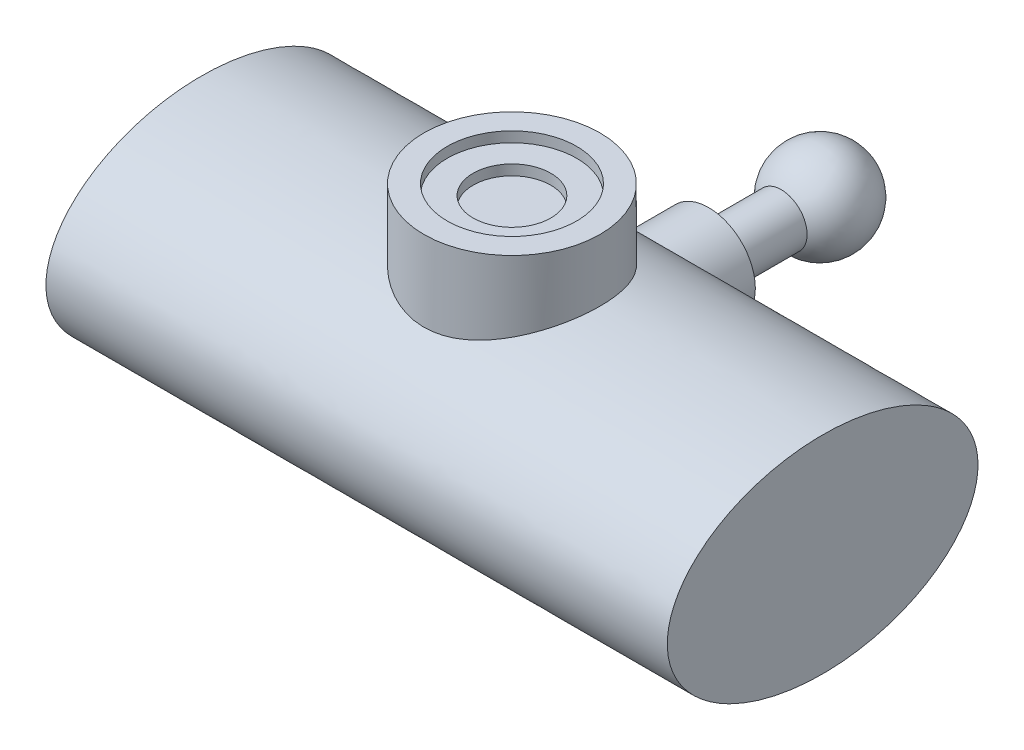
ISO-10303-21;
HEADER;
FILE_DESCRIPTION(('STEP AP214'),'2;1');
FILE_NAME('part.step','',(''),(''),'','','');
FILE_SCHEMA(('AUTOMOTIVE_DESIGN { 1 0 10303 214 1 1 1 1 }'));
ENDSEC;
DATA;
#1=APPLICATION_CONTEXT('core data for automotive mechanical design processes');
#2=APPLICATION_PROTOCOL_DEFINITION('international standard','automotive_design',2000,#1);
#3=PRODUCT_CONTEXT('',#1,'mechanical');
#4=PRODUCT('Part','Part','',(#3));
#5=PRODUCT_RELATED_PRODUCT_CATEGORY('part','',(#4));
#6=PRODUCT_DEFINITION_FORMATION('','',#4);
#7=PRODUCT_DEFINITION_CONTEXT('part definition',#1,'design');
#8=PRODUCT_DEFINITION('design','',#6,#7);
#9=PRODUCT_DEFINITION_SHAPE('','',#8);
#10=(LENGTH_UNIT() NAMED_UNIT(*) SI_UNIT(.MILLI.,.METRE.));
#11=(NAMED_UNIT(*) PLANE_ANGLE_UNIT() SI_UNIT($,.RADIAN.));
#12=(NAMED_UNIT(*) SI_UNIT($,.STERADIAN.) SOLID_ANGLE_UNIT());
#13=UNCERTAINTY_MEASURE_WITH_UNIT(LENGTH_MEASURE(1.E-05),#10,'distance_accuracy_value','');
#14=(GEOMETRIC_REPRESENTATION_CONTEXT(3) GLOBAL_UNCERTAINTY_ASSIGNED_CONTEXT((#13)) GLOBAL_UNIT_ASSIGNED_CONTEXT((#10,
#11,#12)) REPRESENTATION_CONTEXT('',''));
#15=CARTESIAN_POINT('',(0.,0.,0.));
#16=DIRECTION('',(0.,0.,1.));
#17=DIRECTION('',(1.,0.,0.));
#18=AXIS2_PLACEMENT_3D('',#15,#16,#17);
#19=CARTESIAN_POINT('',(-30.,0.,26.));
#20=DIRECTION('',(1.,0.,0.));
#21=DIRECTION('',(0.,0.,-1.));
#22=AXIS2_PLACEMENT_3D('',#19,#20,#21);
#23=ELLIPSE('',#22,15.,10.);
#24=DIRECTION('',(1.,0.,0.));
#25=VECTOR('',#24,1.);
#26=SURFACE_OF_LINEAR_EXTRUSION('',#23,#25);
#27=CARTESIAN_POINT('',(-4.5,0.,11.));
#28=CARTESIAN_POINT('',(-4.50000179661353,0.113427751797759,10.999998104076));
#29=CARTESIAN_POINT('',(-4.49570683559703,0.226836941344397,11.002901009246));
#30=CARTESIAN_POINT('',(-4.47859826356174,0.452757044180179,11.0144232925091));
#31=CARTESIAN_POINT('',(-4.46578222935199,0.565267692732317,11.0230442966921));
#32=CARTESIAN_POINT('',(-4.43180974817744,0.788562805828208,11.0457667567975));
#33=CARTESIAN_POINT('',(-4.41064538078484,0.899345526949475,11.0598734170206));
#34=CARTESIAN_POINT('',(-4.36027244405676,1.11832652619657,11.0931795221124));
#35=CARTESIAN_POINT('',(-4.33106041679894,1.2265236715837,11.1123811560608));
#36=CARTESIAN_POINT('',(-4.26517045877855,1.4389622519027,11.1552431101488));
#37=CARTESIAN_POINT('',(-4.22853884802476,1.54322368635741,11.1788757031795));
#38=CARTESIAN_POINT('',(-4.14810455225398,1.74795320879676,11.2301062680023));
#39=CARTESIAN_POINT('',(-4.10429905696046,1.84841979113998,11.2577057932682));
#40=CARTESIAN_POINT('',(-3.96276861330985,2.14335152297756,11.3455197985101));
#41=CARTESIAN_POINT('',(-3.85486940196405,2.33154018599745,11.4107901373745));
#42=CARTESIAN_POINT('',(-3.60392158054914,2.70501209204091,11.5560344890988));
#43=CARTESIAN_POINT('',(-3.45853379199128,2.88838865227078,11.6368120136786));
#44=CARTESIAN_POINT('',(-3.14178140430147,3.23009476219036,11.8015115384798));
#45=CARTESIAN_POINT('',(-2.9703833618687,3.38839152146735,11.8854374807371));
#46=CARTESIAN_POINT('',(-2.68273694898729,3.61533784930147,12.0139878374257));
#47=CARTESIAN_POINT('',(-2.57435341999766,3.69332312112326,12.0600339860247));
#48=CARTESIAN_POINT('',(-2.35022785291713,3.83983685883343,12.1493942924411));
#49=CARTESIAN_POINT('',(-2.23448450976205,3.90836364064517,12.1927079629995));
#50=CARTESIAN_POINT('',(-1.99631105152499,4.03521042570358,12.2750533001104));
#51=CARTESIAN_POINT('',(-1.87389086705864,4.09354507251045,12.3140910794386));
#52=CARTESIAN_POINT('',(-1.62284749952471,4.1993929358368,12.3864372558138));
#53=CARTESIAN_POINT('',(-1.4942268565902,4.24691053886781,12.4197479739441));
#54=CARTESIAN_POINT('',(-1.26509018908745,4.31973368078795,12.4716061814889));
#55=CARTESIAN_POINT('',(-1.16574768179169,4.34761470798694,12.4917536413799));
#56=CARTESIAN_POINT('',(-0.964612007304901,4.39661582407501,12.5274851960585));
#57=CARTESIAN_POINT('',(-0.862819399121535,4.41773743974061,12.5430703212919));
#58=CARTESIAN_POINT('',(-0.657476723721926,4.45292768238192,12.5691922199446));
#59=CARTESIAN_POINT('',(-0.553928380872625,4.46700285717636,12.5797336797233));
#60=CARTESIAN_POINT('',(-0.345691829615696,4.48792223892815,12.5954464292999));
#61=CARTESIAN_POINT('',(-0.241003597346981,4.49476629422273,12.6006176064634));
#62=CARTESIAN_POINT('',(-0.0310453054331663,4.50112106870681,12.6054180778743));
#63=CARTESIAN_POINT('',(0.0742255277903985,4.50061560625957,12.6050351434851));
#64=CARTESIAN_POINT('',(0.284304014194313,4.49224025645326,12.5987109629353));
#65=CARTESIAN_POINT('',(0.389111666587928,4.48437035659018,12.5927697073373));
#66=CARTESIAN_POINT('',(0.59753363976473,4.46138456087639,12.5755269335715));
#67=CARTESIAN_POINT('',(0.70114731240602,4.44626490329595,12.5642226326772));
#68=CARTESIAN_POINT('',(0.906420191381641,4.40900057668016,12.5366209701257));
#69=CARTESIAN_POINT('',(1.00807936731996,4.38685579848486,12.5203235308826));
#70=CARTESIAN_POINT('',(1.20684557721036,4.33633809787617,12.4835980616951));
#71=CARTESIAN_POINT('',(1.3040029534458,4.30809806452624,12.4632588050804));
#72=CARTESIAN_POINT('',(1.49543340489877,4.24544833923509,12.4187969731321));
#73=CARTESIAN_POINT('',(1.58970548077597,4.21103653735249,12.3946731043083));
#74=CARTESIAN_POINT('',(1.86759038030875,4.09902022836665,12.3175003233271));
#75=CARTESIAN_POINT('',(2.04638550636764,4.01260547275993,12.2596281114524));
#76=CARTESIAN_POINT('',(2.41679295890204,3.80283298823422,12.1257342598217));
#77=CARTESIAN_POINT('',(2.60576432697492,3.67575343801002,12.0482915618635));
#78=CARTESIAN_POINT('',(2.96165670497873,3.39558471419742,11.8894313029242));
#79=CARTESIAN_POINT('',(3.12855059043843,3.24246406449339,11.8080090176696));
#80=CARTESIAN_POINT('',(3.46408364274005,2.88440804907728,11.6343295005055));
#81=CARTESIAN_POINT('',(3.62837513293085,2.67509021151676,11.5425289658539));
#82=CARTESIAN_POINT('',(3.84650148734915,2.33928769412491,11.4151611589783));
#83=CARTESIAN_POINT('',(3.91449348979772,2.22371190570305,11.3744262675036));
#84=CARTESIAN_POINT('',(4.04042479072698,1.98571503458002,11.2975729325259));
#85=CARTESIAN_POINT('',(4.09836705045653,1.86329598241597,11.2614531299735));
#86=CARTESIAN_POINT('',(4.1925136057426,1.63843067480823,11.2019279765487));
#87=CARTESIAN_POINT('',(4.2307339239465,1.53710867483584,11.1774393910207));
#88=CARTESIAN_POINT('',(4.29998446964481,1.33113882007355,11.1326700450054));
#89=CARTESIAN_POINT('',(4.33101618728443,1.22649165968925,11.1123884125382));
#90=CARTESIAN_POINT('',(4.3855094700779,1.01453053362565,11.0765382428872));
#91=CARTESIAN_POINT('',(4.40897647643548,0.907218544834051,11.0609663185684));
#92=CARTESIAN_POINT('',(4.44806119478178,0.690556060860621,11.0349200564462));
#93=CARTESIAN_POINT('',(4.46367877421417,0.581205531285499,11.0244458047293));
#94=CARTESIAN_POINT('',(4.48687763286799,0.360887958636143,11.0088554284552));
#95=CARTESIAN_POINT('',(4.49443095207693,0.249916634964487,11.0037579467049));
#96=CARTESIAN_POINT('',(4.50128932226477,0.0276022757401435,10.9991303202973));
#97=CARTESIAN_POINT('',(4.50059437511811,-0.0837407597280662,10.9996001743749));
#98=CARTESIAN_POINT('',(4.49096626715139,-0.305922193008737,11.0060942616813));
#99=CARTESIAN_POINT('',(4.48203186670135,-0.416760512364704,11.0121193306951));
#100=CARTESIAN_POINT('',(4.45606001427732,-0.637048543935594,11.029553870837));
#101=CARTESIAN_POINT('',(4.43902270985223,-0.746498281398482,11.0409632439203));
#102=CARTESIAN_POINT('',(4.39816713569207,-0.957646057710932,11.0681380131166));
#103=CARTESIAN_POINT('',(4.37474242379664,-1.05945337025825,11.0836493637226));
#104=CARTESIAN_POINT('',(4.32109931219396,-1.2605329468572,11.1188718356031));
#105=CARTESIAN_POINT('',(4.29087858863244,-1.35980433080277,11.1385843933337));
#106=CARTESIAN_POINT('',(4.1905005340399,-1.65296873635818,11.2033829235758));
#107=CARTESIAN_POINT('',(4.11059693349983,-1.84236612863191,11.2541505781957));
#108=CARTESIAN_POINT('',(3.91877250619583,-2.22329796423974,11.3722371155674));
#109=CARTESIAN_POINT('',(3.80451271966262,-2.413288590017,11.4406777339753));
#110=CARTESIAN_POINT('',(3.5511301526749,-2.7727038914783,11.5854144415518));
#111=CARTESIAN_POINT('',(3.41198359303289,-2.94210863515252,11.6617180139171));
#112=CARTESIAN_POINT('',(3.08631648900501,-3.28472085582264,11.829309093388));
#113=CARTESIAN_POINT('',(2.89576699053932,-3.45392474195579,11.9209878613513));
#114=CARTESIAN_POINT('',(2.48696209994966,-3.75899613254762,12.0979294572261));
#115=CARTESIAN_POINT('',(2.26871396155728,-3.89487233765052,12.1831939556316));
#116=CARTESIAN_POINT('',(1.84397141975699,-4.11059794030257,12.3249182480302));
#117=CARTESIAN_POINT('',(1.64110822990307,-4.19591661167427,12.3838018973718));
#118=CARTESIAN_POINT('',(1.32629457494211,-4.30153704143316,12.4585404951784));
#119=CARTESIAN_POINT('',(1.21960759709212,-4.33301685356221,12.4811883078199));
#120=CARTESIAN_POINT('',(1.00328986689162,-4.38814860065665,12.5212587563962));
#121=CARTESIAN_POINT('',(0.893660466169043,-4.41180406545493,12.5386837481917));
#122=CARTESIAN_POINT('',(0.671387824061793,-4.45107495470949,12.5678022585084));
#123=CARTESIAN_POINT('',(0.558728579140754,-4.4666313400165,12.5794536609622));
#124=CARTESIAN_POINT('',(0.332073640419358,-4.48917523480886,12.5963885825209));
#125=CARTESIAN_POINT('',(0.218077954497075,-4.49616279478024,12.6016721391439));
#126=CARTESIAN_POINT('',(-0.0102109097294636,-4.5014364012271,12.6056568556563));
#127=CARTESIAN_POINT('',(-0.124504034273567,-4.49972392396281,12.604359132286));
#128=CARTESIAN_POINT('',(-0.3523605073897,-4.48763387513054,12.5952369613043));
#129=CARTESIAN_POINT('',(-0.465923899310071,-4.47725682315053,12.5874129050571));
#130=CARTESIAN_POINT('',(-0.67923468310089,-4.44959929737168,12.5667252536962));
#131=CARTESIAN_POINT('',(-0.779156752898353,-4.43317928607142,12.5544926666724));
#132=CARTESIAN_POINT('',(-0.977042697073361,-4.39381133925923,12.5254491587045));
#133=CARTESIAN_POINT('',(-1.07500591430874,-4.37086125113962,12.5086367281154));
#134=CARTESIAN_POINT('',(-1.36511414597717,-4.29261252060113,12.4520128996179));
#135=CARTESIAN_POINT('',(-1.55359686105713,-4.22789955962537,12.4060025334264));
#136=CARTESIAN_POINT('',(-1.93310950394273,-4.06927952389765,12.2974236488978));
#137=CARTESIAN_POINT('',(-2.122961598469,-3.97333863531185,12.233770590982));
#138=CARTESIAN_POINT('',(-2.48517306088189,-3.75745013592127,12.0980430526655));
#139=CARTESIAN_POINT('',(-2.65752147832485,-3.63748763474619,12.0259633604053));
#140=CARTESIAN_POINT('',(-3.01530948599678,-3.34969077399854,11.8643378935222));
#141=CARTESIAN_POINT('',(-3.19666612782305,-3.17708160832445,11.7741433128102));
#142=CARTESIAN_POINT('',(-3.4460710098894,-2.89659995275487,11.6422994952934));
#143=CARTESIAN_POINT('',(-3.52549816686507,-2.79941005551074,11.5988871174457));
#144=CARTESIAN_POINT('',(-3.67639443055727,-2.59806555930813,11.5142416740982));
#145=CARTESIAN_POINT('',(-3.74786221934094,-2.49390981148232,11.4730089701066));
#146=CARTESIAN_POINT('',(-3.88653423833227,-2.27222651620535,11.3912915177966));
#147=CARTESIAN_POINT('',(-3.95318017729316,-2.15426984842072,11.3510202467923));
#148=CARTESIAN_POINT('',(-4.076059538743,-1.91160147196229,11.2754448375747));
#149=CARTESIAN_POINT('',(-4.13229869870981,-1.78689353472326,11.2401379649774));
#150=CARTESIAN_POINT('',(-4.23348505678554,-1.53179028546055,11.1757571788904));
#151=CARTESIAN_POINT('',(-4.27846027883129,-1.40141005473585,11.1466678236252));
#152=CARTESIAN_POINT('',(-4.35649158363439,-1.13583379404724,11.0957216245096));
#153=CARTESIAN_POINT('',(-4.38955548718639,-1.0006409882668,11.0738600357939));
#154=CARTESIAN_POINT('',(-4.44399003871495,-0.722290681803393,11.037665045924));
#155=CARTESIAN_POINT('',(-4.4649479028609,-0.579017000181097,11.0235979987963));
#156=CARTESIAN_POINT('',(-4.49295171576239,-0.290485399314258,11.0047667013232));
#157=CARTESIAN_POINT('',(-4.4999976997017,-0.145227485088864,11.0000024274507));
#158=CARTESIAN_POINT('',(-4.5,0.,11.));
#159=B_SPLINE_CURVE_WITH_KNOTS('',3,(#27,#28,#29,#30,#31,#32,#33,#34,#35,#36,#37,#38,#39,#40,
#41,#42,#43,#44,#45,#46,#47,#48,#49,#50,#51,#52,#53,#54,#55,#56,#57,#58,#59,#60,#61,#62,#63,#64,
#65,#66,#67,#68,#69,#70,#71,#72,#73,#74,#75,#76,#77,#78,#79,#80,#81,#82,#83,#84,#85,#86,#87,#88,
#89,#90,#91,#92,#93,#94,#95,#96,#97,#98,#99,#100,#101,#102,#103,#104,#105,#106,#107,#108,#109,
#110,#111,#112,#113,#114,#115,#116,#117,#118,#119,#120,#121,#122,#123,#124,#125,#126,#127,#128,
#129,#130,#131,#132,#133,#134,#135,#136,#137,#138,#139,#140,#141,#142,#143,#144,#145,#146,#147,
#148,#149,#150,#151,#152,#153,#154,#155,#156,#157,#158),.UNSPECIFIED.,.T.,.F.,(4,2,2,2,2,2,2,2,
2,2,2,2,2,2,2,2,2,2,2,2,2,2,2,2,2,2,2,2,2,2,2,2,2,2,2,2,2,2,2,2,2,2,2,2,2,2,2,2,2,2,2,2,2,2,2,2,
2,2,2,2,2,2,2,2,2,4),(0.,0.340133977224594,0.680364721873554,1.02091903766603,1.36161991184411,
1.70025597043293,2.03902500404053,2.71595528338829,3.45599766251007,4.19699975952383,
4.62027501382067,5.04362553499175,5.46636271360192,5.88892815786315,6.20400329255007,
6.51900720958741,6.83371786724526,7.14843512539484,7.46384540997294,7.77925623008434,
8.09483088688747,8.41041044749295,8.71970201041908,9.0290995130492,9.6475397386973,
10.3665098752997,11.086355295658,11.9262098886761,12.3461636741822,12.7659935054501,
13.098739900695,13.4314172581587,13.7638547881668,14.0962979319883,14.4298900002783,
14.7634819927587,15.0971241825146,15.4307602970841,15.7472473454301,16.0638427795728,
16.6965634639746,17.3900897781859,18.0842823283624,18.8932694758549,19.7020452009277,
20.3824710118762,20.7226592902244,21.0626938879199,21.4051736737468,21.7476514417328,
22.0900710985393,22.4324702229634,22.7381204964925,23.0438716430928,23.6550155642333,
24.3187766546416,24.9829504740448,25.7776417863957,26.1757352892663,26.5738946117947,
26.9973185201674,27.4205082858827,27.8426344835977,28.2644830121933,28.699975440192,
29.1354667668091),.UNSPECIFIED.);
#160=CARTESIAN_POINT('',(-4.5,0.,11.));
#161=VERTEX_POINT('',#160);
#162=EDGE_CURVE('E86',#161,#161,#159,.T.);
#163=ORIENTED_EDGE('',*,*,#162,.F.);
#164=EDGE_LOOP('',(#163));
#165=FACE_BOUND('',#164,.T.);
#166=CARTESIAN_POINT('',(30.,0.,26.));
#167=DIRECTION('',(1.,0.,0.));
#168=DIRECTION('',(0.,0.,-1.));
#169=AXIS2_PLACEMENT_3D('',#166,#167,#168);
#170=ELLIPSE('',#169,15.,10.);
#171=CARTESIAN_POINT('',(30.,0.,11.));
#172=VERTEX_POINT('',#171);
#173=EDGE_CURVE('E108',#172,#172,#170,.T.);
#174=ORIENTED_EDGE('',*,*,#173,.F.);
#175=EDGE_LOOP('',(#174));
#176=FACE_BOUND('',#175,.T.);
#177=CARTESIAN_POINT('',(-30.,0.,11.));
#178=VERTEX_POINT('',#177);
#179=EDGE_CURVE('E93',#178,#178,#23,.T.);
#180=ORIENTED_EDGE('',*,*,#179,.T.);
#181=EDGE_LOOP('',(#180));
#182=FACE_BOUND('',#181,.T.);
#183=CARTESIAN_POINT('',(0.,8.23947139620604,17.5000000000004));
#184=CARTESIAN_POINT('',(0.223826071442597,8.23947301211789,17.5000013876241));
#185=CARTESIAN_POINT('',(0.447734459925835,8.243540331611,17.5088535242802));
#186=CARTESIAN_POINT('',(0.893966089108362,8.25966017030362,17.5441750739895));
#187=CARTESIAN_POINT('',(1.11628819945479,8.27171790114709,17.570655985238));
#188=CARTESIAN_POINT('',(1.55814361221104,8.30339845870829,17.6410321665077));
#189=CARTESIAN_POINT('',(1.77766930888649,8.32303865168037,17.6849674192867));
#190=CARTESIAN_POINT('',(2.21190385110959,8.36916437209944,17.7898001768126));
#191=CARTESIAN_POINT('',(2.42661227943886,8.39565048999632,17.8506991446876));
#192=CARTESIAN_POINT('',(2.84895971129045,8.45442909036648,17.9885972503922));
#193=CARTESIAN_POINT('',(3.05662442376914,8.48669694197005,18.0655283079259));
#194=CARTESIAN_POINT('',(3.46463745079335,8.55608395314175,18.2350085304334));
#195=CARTESIAN_POINT('',(3.66498551908996,8.59320327579878,18.3275582204796));
#196=CARTESIAN_POINT('',(4.05724138712297,8.67118252456188,18.5275676759396));
#197=CARTESIAN_POINT('',(4.2491519704762,8.71204120309578,18.6350224746437));
#198=CARTESIAN_POINT('',(4.62366523547322,8.79639340137041,18.8641804841427));
#199=CARTESIAN_POINT('',(4.80626736108067,8.83988707817269,18.9858845446823));
#200=CARTESIAN_POINT('',(5.17412279304689,8.93160126350604,19.2521365718769));
#201=CARTESIAN_POINT('',(5.35861355764531,8.97993618711974,19.397699905987));
#202=CARTESIAN_POINT('',(5.71478351915561,9.07701227934481,19.7034676978128));
#203=CARTESIAN_POINT('',(5.88646760794631,9.12575328485038,19.8636665125237));
#204=CARTESIAN_POINT('',(6.21623688702605,9.22242804891593,20.1979691132443));
#205=CARTESIAN_POINT('',(6.37431205736054,9.27036119213112,20.372082965765));
#206=CARTESIAN_POINT('',(6.67568457052204,9.36416365931079,20.7330747674103));
#207=CARTESIAN_POINT('',(6.81898712184921,9.41003370743954,20.9199481788979));
#208=CARTESIAN_POINT('',(7.09490866869479,9.50023953574686,21.3125762504129));
#209=CARTESIAN_POINT('',(7.22693839073453,9.54445626096369,21.5187731625842));
#210=CARTESIAN_POINT('',(7.47306881870933,9.62832782896457,21.9425039796207));
#211=CARTESIAN_POINT('',(7.58716893244338,9.66798252105662,22.1600382586345));
#212=CARTESIAN_POINT('',(7.79638876307782,9.741681135902,22.6048976341687));
#213=CARTESIAN_POINT('',(7.89151378151209,9.77572662537068,22.8322199743183));
#214=CARTESIAN_POINT('',(8.06188719407887,9.83731895022829,23.2950466490371));
#215=CARTESIAN_POINT('',(8.1371367617531,9.86486616929592,23.5305504996014));
#216=CARTESIAN_POINT('',(8.2639219986207,9.9116038185268,23.9967092150158));
#217=CARTESIAN_POINT('',(8.31640414259958,9.9311255240141,24.2270736745726));
#218=CARTESIAN_POINT('',(8.40205772382955,9.96311671593995,24.6918497569));
#219=CARTESIAN_POINT('',(8.43522970626848,9.97558640147938,24.926261265217));
#220=CARTESIAN_POINT('',(8.48190254292267,9.99315988461634,25.3972434418982));
#221=CARTESIAN_POINT('',(8.49540890147593,9.99826574331895,25.6338134874336));
#222=CARTESIAN_POINT('',(8.50261966991353,10.0009895240807,26.1072952486588));
#223=CARTESIAN_POINT('',(8.49632469124433,9.99860767735297,26.3442069535727));
#224=CARTESIAN_POINT('',(8.46481412424188,9.98672281931004,26.8046661087129));
#225=CARTESIAN_POINT('',(8.44056029386674,9.97758181708727,27.0282894976787));
#226=CARTESIAN_POINT('',(8.37448636563997,9.95280586004161,27.472551528623));
#227=CARTESIAN_POINT('',(8.33266696954687,9.93717116464729,27.6931902894764));
#228=CARTESIAN_POINT('',(8.23185626218885,9.89975769593683,28.1299720279388));
#229=CARTESIAN_POINT('',(8.17286490569716,9.87797890643866,28.3461149937052));
#230=CARTESIAN_POINT('',(8.03823885545271,9.82875863464863,28.7724897815615));
#231=CARTESIAN_POINT('',(7.9626037786335,9.80131702202399,28.9827214674737));
#232=CARTESIAN_POINT('',(7.79445571707964,9.74105771619501,29.3981155831786));
#233=CARTESIAN_POINT('',(7.70177522423072,9.70818703005336,29.603202456198));
#234=CARTESIAN_POINT('',(7.50077383890588,9.63798684395928,30.0048526166814));
#235=CARTESIAN_POINT('',(7.392447323431,9.60065574182192,30.2014128065885));
#236=CARTESIAN_POINT('',(7.16096363447629,9.52235855462546,30.5848394940473));
#237=CARTESIAN_POINT('',(7.03780592483332,9.48139233816727,30.7717056407997));
#238=CARTESIAN_POINT('',(6.77747736058284,9.3967202353108,31.1347542588992));
#239=CARTESIAN_POINT('',(6.64030577359974,9.35301420577402,31.3109361711128));
#240=CARTESIAN_POINT('',(6.34445875758179,9.26124622454769,31.6615774962853));
#241=CARTESIAN_POINT('',(6.18499835495175,9.2130785550557,31.8353474997309));
#242=CARTESIAN_POINT('',(5.85231737203551,9.11597512618356,32.1689446530438));
#243=CARTESIAN_POINT('',(5.67909633736472,9.06703934148264,32.3287713421282));
#244=CARTESIAN_POINT('',(5.31983360978287,8.96966964611511,32.6336180990124));
#245=CARTESIAN_POINT('',(5.13378729848449,8.92123592354001,32.7786327858607));
#246=CARTESIAN_POINT('',(4.74994416385345,8.82622896736984,33.0529199968707));
#247=CARTESIAN_POINT('',(4.55214588951522,8.77965596470861,33.1821905710843));
#248=CARTESIAN_POINT('',(4.13896198559302,8.68822330699745,33.4282409376099));
#249=CARTESIAN_POINT('',(3.9232062432388,8.64347669552495,33.5444424607965));
#250=CARTESIAN_POINT('',(3.48174803788924,8.5590211578781,33.758062305051));
#251=CARTESIAN_POINT('',(3.25604988918073,8.51931007510306,33.8554886764385));
#252=CARTESIAN_POINT('',(2.7962057708535,8.4464043520622,34.030675159956));
#253=CARTESIAN_POINT('',(2.56206283116984,8.41320740156823,34.1084422470556));
#254=CARTESIAN_POINT('',(2.08698839038467,8.35466766771735,34.2435094022696));
#255=CARTESIAN_POINT('',(1.84605746544989,8.32932421993016,34.3008112018724));
#256=CARTESIAN_POINT('',(1.37347997385535,8.28880812441326,34.3915458697071));
#257=CARTESIAN_POINT('',(1.14210517787154,8.27313091405973,34.4261701621131));
#258=CARTESIAN_POINT('',(0.676868157371376,8.25036971048445,34.47623605731));
#259=CARTESIAN_POINT('',(0.443006033268306,8.24328537168733,34.4916784315313));
#260=CARTESIAN_POINT('',(-0.0252185323366505,8.23801104969889,34.50318707568));
#261=CARTESIAN_POINT('',(-0.259580788042708,8.23981819717183,34.4992595963737));
#262=CARTESIAN_POINT('',(-0.726941536740396,8.25224354733433,34.4720919615596));
#263=CARTESIAN_POINT('',(-0.959940072948505,8.26286146926991,34.4488524214276));
#264=CARTESIAN_POINT('',(-1.40708123406717,8.29146060241791,34.3855604477936));
#265=CARTESIAN_POINT('',(-1.62143592745431,8.30889703869859,34.3467473522918));
#266=CARTESIAN_POINT('',(-2.04590803437974,8.35042683362237,34.2529691593179));
#267=CARTESIAN_POINT('',(-2.25602567155111,8.37451983993779,34.1980049167051));
#268=CARTESIAN_POINT('',(-2.67075901894316,8.42856463067372,34.0724220172817));
#269=CARTESIAN_POINT('',(-2.87537440305833,8.45851676148397,34.0018024348991));
#270=CARTESIAN_POINT('',(-3.27802350558709,8.52335992858267,33.8454589748255));
#271=CARTESIAN_POINT('',(-3.47605464862745,8.55825287000843,33.7597292676551));
#272=CARTESIAN_POINT('',(-3.87313407337149,8.63361219403506,33.5696385582736));
#273=CARTESIAN_POINT('',(-4.07183127940065,8.6742581161897,33.464615469693));
#274=CARTESIAN_POINT('',(-4.459867488446,8.7586594551097,33.239469545827));
#275=CARTESIAN_POINT('',(-4.64920326401953,8.80241593176804,33.1193415528607));
#276=CARTESIAN_POINT('',(-5.01752610073787,8.89184750283129,32.8647330818589));
#277=CARTESIAN_POINT('',(-5.19651160446362,8.93752288420033,32.7302504524816));
#278=CARTESIAN_POINT('',(-5.54321427152478,9.02962877149653,32.4476965844847));
#279=CARTESIAN_POINT('',(-5.71093087624955,9.07605931471631,32.2996246730902));
#280=CARTESIAN_POINT('',(-6.04690406443398,9.17218627174215,31.9785520492799));
#281=CARTESIAN_POINT('',(-6.2141729984083,9.22185348135685,31.8045071114903));
#282=CARTESIAN_POINT('',(-6.53347363689901,9.31942173237228,31.4426038627296));
#283=CARTESIAN_POINT('',(-6.68551015940361,9.36732332918411,31.254749952316));
#284=CARTESIAN_POINT('',(-6.97341668183576,9.46015401939145,30.8662044272427));
#285=CARTESIAN_POINT('',(-7.10927956638965,9.50508180066629,30.66550722161));
#286=CARTESIAN_POINT('',(-7.3636610951662,9.5907701211356,30.252675811999));
#287=CARTESIAN_POINT('',(-7.48218720325027,9.63153245135643,30.0405465839033));
#288=CARTESIAN_POINT('',(-7.70058207377071,9.70773655498967,29.6069051357526));
#289=CARTESIAN_POINT('',(-7.80051361819887,9.74319614968836,29.3854277054559));
#290=CARTESIAN_POINT('',(-7.98129555841558,9.8080527548611,28.9339471934475));
#291=CARTESIAN_POINT('',(-8.06214582370228,9.8374497238711,28.7039440534387));
#292=CARTESIAN_POINT('',(-8.20392260790352,9.88940712124127,28.2372114579513));
#293=CARTESIAN_POINT('',(-8.26485651308617,9.91197008386269,28.0004845315682));
#294=CARTESIAN_POINT('',(-8.36618135836584,9.94967828324883,27.5220968116317));
#295=CARTESIAN_POINT('',(-8.40657351459594,9.96482395913716,27.2804363110419));
#296=CARTESIAN_POINT('',(-8.46457256810448,9.98662340900635,26.8087366857814));
#297=CARTESIAN_POINT('',(-8.48339847117776,9.99373116880519,26.5788676489993));
#298=CARTESIAN_POINT('',(-8.50230199998196,10.0008683297942,26.1182546534257));
#299=CARTESIAN_POINT('',(-8.50238041831321,10.0008980302284,25.8875107320348));
#300=CARTESIAN_POINT('',(-8.48379044009783,9.99387907036976,25.4269241220793));
#301=CARTESIAN_POINT('',(-8.46512479226632,9.9868314479277,25.1970813063337));
#302=CARTESIAN_POINT('',(-8.40924333641117,9.96582696300058,24.7399838285081));
#303=CARTESIAN_POINT('',(-8.37202761192846,9.9518701316314,24.5127291547769));
#304=CARTESIAN_POINT('',(-8.28071233298427,9.91785833855255,24.0687487873872));
#305=CARTESIAN_POINT('',(-8.22711222463142,9.89798416778483,23.8519061666721));
#306=CARTESIAN_POINT('',(-8.1032235000665,9.85245734493289,23.4236748088728));
#307=CARTESIAN_POINT('',(-8.03293531372059,9.82680484169291,23.2122859314619));
#308=CARTESIAN_POINT('',(-7.87627478606011,9.7702807239247,22.7963007126436));
#309=CARTESIAN_POINT('',(-7.78990370082315,9.73940951699559,22.5917038422484));
#310=CARTESIAN_POINT('',(-7.60172660557648,9.67309828929428,22.1904213649359));
#311=CARTESIAN_POINT('',(-7.49991472004447,9.63765653011051,21.9937388057694));
#312=CARTESIAN_POINT('',(-7.27769853048999,9.56162402999211,21.602559137086));
#313=CARTESIAN_POINT('',(-7.15675886587803,9.5208943240608,21.4083926858839));
#314=CARTESIAN_POINT('',(-6.89998603102083,9.43627467602131,21.0308582356246));
#315=CARTESIAN_POINT('',(-6.76414730504851,9.39238355715915,20.8474943041757));
#316=CARTESIAN_POINT('',(-6.33564130847865,9.25747047813386,20.3152005668573));
#317=CARTESIAN_POINT('',(-6.02183005895945,9.16315422209205,19.9837987021451));
#318=CARTESIAN_POINT('',(-5.3253452629494,8.96917540014114,19.3575160543847));
#319=CARTESIAN_POINT('',(-4.93971789167204,8.86952272881492,19.06590430464));
#320=CARTESIAN_POINT('',(-4.32712974283205,8.72893543327007,18.6798589051292));
#321=CARTESIAN_POINT('',(-4.1170402885543,8.68351850443579,18.559655106611));
#322=CARTESIAN_POINT('',(-3.68668082745529,8.59714587607496,18.3373009348608));
#323=CARTESIAN_POINT('',(-3.46641547193322,8.55618816646728,18.2351424143289));
#324=CARTESIAN_POINT('',(-3.01718043077527,8.48020445914974,18.049801614867));
#325=CARTESIAN_POINT('',(-2.7882148900074,8.44517567915979,17.9666104287037));
#326=CARTESIAN_POINT('',(-2.32316664584224,8.38239721224071,17.8200068634951));
#327=CARTESIAN_POINT('',(-2.08708749562452,8.35464395631402,17.7565847838464));
#328=CARTESIAN_POINT('',(-1.61019667725078,8.30762092697919,17.6503416575444));
#329=CARTESIAN_POINT('',(-1.36939970743882,8.28832817408678,17.607464778525));
#330=CARTESIAN_POINT('',(-0.884575579297553,8.25898318182936,17.5426214083519));
#331=CARTESIAN_POINT('',(-0.640551156463665,8.24892356944568,17.5206382322718));
#332=CARTESIAN_POINT('',(-0.330086789740515,8.24229173526876,17.5061545111236));
#333=CARTESIAN_POINT('',(-0.264097295331672,8.24123479855962,17.503847161176));
#334=CARTESIAN_POINT('',(-0.132074256140013,8.23982438933111,17.5007696980471));
#335=CARTESIAN_POINT('',(-0.0660407111944533,8.23947091942526,17.4999995905769));
#336=CARTESIAN_POINT('',(0.,8.23947139620604,17.5000000000004));
#337=B_SPLINE_CURVE_WITH_KNOTS('',3,(#183,#184,#185,#186,#187,#188,#189,#190,#191,#192,#193,
#194,#195,#196,#197,#198,#199,#200,#201,#202,#203,#204,#205,#206,#207,#208,#209,#210,#211,#212,
#213,#214,#215,#216,#217,#218,#219,#220,#221,#222,#223,#224,#225,#226,#227,#228,#229,#230,#231,
#232,#233,#234,#235,#236,#237,#238,#239,#240,#241,#242,#243,#244,#245,#246,#247,#248,#249,#250,
#251,#252,#253,#254,#255,#256,#257,#258,#259,#260,#261,#262,#263,#264,#265,#266,#267,#268,#269,
#270,#271,#272,#273,#274,#275,#276,#277,#278,#279,#280,#281,#282,#283,#284,#285,#286,#287,#288,
#289,#290,#291,#292,#293,#294,#295,#296,#297,#298,#299,#300,#301,#302,#303,#304,#305,#306,#307,
#308,#309,#310,#311,#312,#313,#314,#315,#316,#317,#318,#319,#320,#321,#322,#323,#324,#325,#326,
#327,#328,#329,#330,#331,#332,#333,#334,#335,#336),.UNSPECIFIED.,.T.,.F.,(4,2,2,2,2,2,2,2,2,2,2,
2,2,2,2,2,2,2,2,2,2,2,2,2,2,2,2,2,2,2,2,2,2,2,2,2,2,2,2,2,2,2,2,2,2,2,2,2,2,2,2,2,2,2,2,2,2,2,2,
2,2,2,2,2,2,2,2,2,2,2,2,2,2,2,2,2,4),(0.,0.671410570720991,1.34325949201552,2.01665637835719,
2.69011136347735,3.36076276058,4.03143670835756,4.70188770732412,5.37237870854872,
6.09133796208973,6.81002116699239,7.52922907644384,8.24818253544423,8.99366294489334,
9.73916797180717,10.4844644162074,11.2297168448974,11.9400253173362,12.6503137345145,
13.3604033062552,14.0704709513207,14.7450355763115,15.4195732544634,16.0941127091997,
16.7686676905405,17.4502450326633,18.1320679381039,18.8139154995576,19.4957987131156,
20.2171334532797,20.9384920222719,21.6601117235555,22.3818207085592,23.1282082281841,
23.8742749997963,24.6200766997263,25.3658152853203,26.0683101515514,26.7707767649487,
27.4730167030436,28.1752342652285,28.8301020384119,29.4849351565321,30.139806999901,
30.7949320477745,31.4793748390759,32.1640519763187,32.8488318711837,33.5336456862702,
34.2721250681238,35.0103701277461,35.7489387773695,36.4871885151833,37.2228985368026,
37.9586135899891,38.6940554822724,39.4294538291221,40.1208388446942,40.8121946301004,
41.5034490467524,42.1947003503433,42.8666869562712,43.5386562544555,44.2105730936988,
44.8827462547514,45.578997383017,46.2755090254983,47.6675959024789,49.1410904623548,
49.8791526236152,50.6168806991571,51.3542616139952,52.091280127965,52.8262842444023,
53.560700919777,53.7588023588796,53.9569045339663),.UNSPECIFIED.);
#338=CARTESIAN_POINT('',(0.,8.23947139620604,17.5000000000004));
#339=VERTEX_POINT('',#338);
#340=EDGE_CURVE('E72',#339,#339,#337,.T.);
#341=ORIENTED_EDGE('',*,*,#340,.T.);
#342=EDGE_LOOP('',(#341));
#343=FACE_BOUND('',#342,.T.);
#344=ADVANCED_FACE('F68',(#165,#176,#182,#343),#26,.T.);
#345=CARTESIAN_POINT('',(0.,0.,7.));
#346=DIRECTION('',(0.,0.,-1.));
#347=DIRECTION('',(-1.,0.,0.));
#348=AXIS2_PLACEMENT_3D('',#345,#346,#347);
#349=CYLINDRICAL_SURFACE('',#348,2.5);
#350=CARTESIAN_POINT('',(0.,0.,7.));
#351=DIRECTION('',(0.,0.,1.));
#352=DIRECTION('',(1.,0.,0.));
#353=AXIS2_PLACEMENT_3D('',#350,#351,#352);
#354=CIRCLE('',#353,2.5);
#355=CARTESIAN_POINT('',(2.5,0.,7.));
#356=VERTEX_POINT('',#355);
#357=EDGE_CURVE('E49',#356,#356,#354,.T.);
#358=ORIENTED_EDGE('',*,*,#357,.F.);
#359=EDGE_LOOP('',(#358));
#360=FACE_BOUND('',#359,.T.);
#361=CARTESIAN_POINT('',(0.,0.,0.));
#362=DIRECTION('',(0.,0.,1.));
#363=DIRECTION('',(1.,0.,0.));
#364=AXIS2_PLACEMENT_3D('',#361,#362,#363);
#365=CIRCLE('',#364,2.5);
#366=CARTESIAN_POINT('',(2.5,0.,0.));
#367=VERTEX_POINT('',#366);
#368=EDGE_CURVE('E124',#367,#367,#365,.F.);
#369=ORIENTED_EDGE('',*,*,#368,.F.);
#370=EDGE_LOOP('',(#369));
#371=FACE_BOUND('',#370,.T.);
#372=ADVANCED_FACE('F70',(#360,#371),#349,.T.);
#373=CARTESIAN_POINT('',(0.,0.,17.));
#374=DIRECTION('',(0.,0.,-1.));
#375=DIRECTION('',(-1.,0.,0.));
#376=AXIS2_PLACEMENT_3D('',#373,#374,#375);
#377=CYLINDRICAL_SURFACE('',#376,4.5);
#378=ORIENTED_EDGE('',*,*,#162,.T.);
#379=EDGE_LOOP('',(#378));
#380=FACE_BOUND('',#379,.T.);
#381=CARTESIAN_POINT('',(0.,0.,7.));
#382=DIRECTION('',(0.,0.,1.));
#383=DIRECTION('',(1.,0.,0.));
#384=AXIS2_PLACEMENT_3D('',#381,#382,#383);
#385=CIRCLE('',#384,4.5);
#386=CARTESIAN_POINT('',(4.5,0.,7.));
#387=VERTEX_POINT('',#386);
#388=EDGE_CURVE('E81',#387,#387,#385,.T.);
#389=ORIENTED_EDGE('',*,*,#388,.T.);
#390=EDGE_LOOP('',(#389));
#391=FACE_BOUND('',#390,.T.);
#392=ADVANCED_FACE('F94',(#380,#391),#377,.T.);
#393=CARTESIAN_POINT('',(0.,0.,7.));
#394=DIRECTION('',(0.,0.,1.));
#395=DIRECTION('',(1.,0.,0.));
#396=AXIS2_PLACEMENT_3D('',#393,#394,#395);
#397=PLANE('',#396);
#398=ORIENTED_EDGE('',*,*,#357,.T.);
#399=EDGE_LOOP('',(#398));
#400=FACE_BOUND('',#399,.T.);
#401=ORIENTED_EDGE('',*,*,#388,.F.);
#402=EDGE_LOOP('',(#401));
#403=FACE_BOUND('',#402,.T.);
#404=ADVANCED_FACE('F103',(#400,#403),#397,.F.);
#405=CARTESIAN_POINT('',(-30.,0.,26.));
#406=DIRECTION('',(1.,0.,0.));
#407=DIRECTION('',(0.,0.,-1.));
#408=AXIS2_PLACEMENT_3D('',#405,#406,#407);
#409=PLANE('',#408);
#410=ORIENTED_EDGE('',*,*,#179,.F.);
#411=EDGE_LOOP('',(#410));
#412=FACE_BOUND('',#411,.T.);
#413=ADVANCED_FACE('F101',(#412),#409,.F.);
#414=CARTESIAN_POINT('',(30.,0.,26.));
#415=DIRECTION('',(1.,0.,0.));
#416=DIRECTION('',(0.,0.,-1.));
#417=AXIS2_PLACEMENT_3D('',#414,#415,#416);
#418=PLANE('',#417);
#419=ORIENTED_EDGE('',*,*,#173,.T.);
#420=EDGE_LOOP('',(#419));
#421=FACE_BOUND('',#420,.T.);
#422=ADVANCED_FACE('F157',(#421),#418,.T.);
#423=CARTESIAN_POINT('',(0.,16.,26.));
#424=DIRECTION('',(0.,-1.,0.));
#425=DIRECTION('',(0.,0.,-1.));
#426=AXIS2_PLACEMENT_3D('',#423,#424,#425);
#427=CYLINDRICAL_SURFACE('',#426,8.5);
#428=ORIENTED_EDGE('',*,*,#340,.F.);
#429=EDGE_LOOP('',(#428));
#430=FACE_BOUND('',#429,.T.);
#431=CARTESIAN_POINT('',(0.,16.,26.));
#432=DIRECTION('',(0.,1.,0.));
#433=DIRECTION('',(0.,0.,1.));
#434=AXIS2_PLACEMENT_3D('',#431,#432,#433);
#435=CIRCLE('',#434,8.5);
#436=CARTESIAN_POINT('',(0.,16.,34.5));
#437=VERTEX_POINT('',#436);
#438=EDGE_CURVE('E111',#437,#437,#435,.T.);
#439=ORIENTED_EDGE('',*,*,#438,.F.);
#440=EDGE_LOOP('',(#439));
#441=FACE_BOUND('',#440,.T.);
#442=ADVANCED_FACE('F153',(#430,#441),#427,.T.);
#443=CARTESIAN_POINT('',(0.,16.,26.));
#444=DIRECTION('',(0.,1.,0.));
#445=DIRECTION('',(0.,0.,1.));
#446=AXIS2_PLACEMENT_3D('',#443,#444,#445);
#447=PLANE('',#446);
#448=CARTESIAN_POINT('',(0.,16.,26.));
#449=DIRECTION('',(0.,1.,0.));
#450=DIRECTION('',(0.,0.,1.));
#451=AXIS2_PLACEMENT_3D('',#448,#449,#450);
#452=CIRCLE('',#451,6.25);
#453=CARTESIAN_POINT('',(0.,16.,32.25));
#454=VERTEX_POINT('',#453);
#455=EDGE_CURVE('E115',#454,#454,#452,.T.);
#456=ORIENTED_EDGE('',*,*,#455,.F.);
#457=EDGE_LOOP('',(#456));
#458=FACE_BOUND('',#457,.T.);
#459=ORIENTED_EDGE('',*,*,#438,.T.);
#460=EDGE_LOOP('',(#459));
#461=FACE_BOUND('',#460,.T.);
#462=ADVANCED_FACE('F156',(#458,#461),#447,.T.);
#463=CARTESIAN_POINT('',(0.,15.,26.));
#464=DIRECTION('',(0.,1.,0.));
#465=DIRECTION('',(0.,0.,1.));
#466=AXIS2_PLACEMENT_3D('',#463,#464,#465);
#467=CYLINDRICAL_SURFACE('',#466,6.25);
#468=CARTESIAN_POINT('',(0.,15.,26.));
#469=DIRECTION('',(0.,1.,0.));
#470=DIRECTION('',(0.,0.,1.));
#471=AXIS2_PLACEMENT_3D('',#468,#469,#470);
#472=CIRCLE('',#471,6.25);
#473=CARTESIAN_POINT('',(0.,15.,32.25));
#474=VERTEX_POINT('',#473);
#475=EDGE_CURVE('E114',#474,#474,#472,.T.);
#476=ORIENTED_EDGE('',*,*,#475,.F.);
#477=EDGE_LOOP('',(#476));
#478=FACE_BOUND('',#477,.T.);
#479=ORIENTED_EDGE('',*,*,#455,.T.);
#480=EDGE_LOOP('',(#479));
#481=FACE_BOUND('',#480,.T.);
#482=ADVANCED_FACE('F161',(#478,#481),#467,.F.);
#483=CARTESIAN_POINT('',(0.,15.,26.));
#484=DIRECTION('',(0.,1.,0.));
#485=DIRECTION('',(0.,0.,1.));
#486=AXIS2_PLACEMENT_3D('',#483,#484,#485);
#487=PLANE('',#486);
#488=CARTESIAN_POINT('',(0.,15.,26.));
#489=DIRECTION('',(0.,1.,0.));
#490=DIRECTION('',(0.,0.,1.));
#491=AXIS2_PLACEMENT_3D('',#488,#489,#490);
#492=CIRCLE('',#491,3.75);
#493=CARTESIAN_POINT('',(0.,15.,29.75));
#494=VERTEX_POINT('',#493);
#495=EDGE_CURVE('E121',#494,#494,#492,.T.);
#496=ORIENTED_EDGE('',*,*,#495,.F.);
#497=EDGE_LOOP('',(#496));
#498=FACE_BOUND('',#497,.T.);
#499=ORIENTED_EDGE('',*,*,#475,.T.);
#500=EDGE_LOOP('',(#499));
#501=FACE_BOUND('',#500,.T.);
#502=ADVANCED_FACE('F167',(#498,#501),#487,.T.);
#503=CARTESIAN_POINT('',(0.,14.,26.));
#504=DIRECTION('',(0.,1.,0.));
#505=DIRECTION('',(0.,0.,1.));
#506=AXIS2_PLACEMENT_3D('',#503,#504,#505);
#507=CYLINDRICAL_SURFACE('',#506,3.75);
#508=CARTESIAN_POINT('',(0.,14.,26.));
#509=DIRECTION('',(0.,1.,0.));
#510=DIRECTION('',(0.,0.,1.));
#511=AXIS2_PLACEMENT_3D('',#508,#509,#510);
#512=CIRCLE('',#511,3.75);
#513=CARTESIAN_POINT('',(0.,14.,29.75));
#514=VERTEX_POINT('',#513);
#515=EDGE_CURVE('E118',#514,#514,#512,.T.);
#516=ORIENTED_EDGE('',*,*,#515,.F.);
#517=EDGE_LOOP('',(#516));
#518=FACE_BOUND('',#517,.T.);
#519=ORIENTED_EDGE('',*,*,#495,.T.);
#520=EDGE_LOOP('',(#519));
#521=FACE_BOUND('',#520,.T.);
#522=ADVANCED_FACE('F228',(#518,#521),#507,.F.);
#523=CARTESIAN_POINT('',(0.,14.,26.));
#524=DIRECTION('',(0.,1.,0.));
#525=DIRECTION('',(0.,0.,1.));
#526=AXIS2_PLACEMENT_3D('',#523,#524,#525);
#527=PLANE('',#526);
#528=ORIENTED_EDGE('',*,*,#515,.T.);
#529=EDGE_LOOP('',(#528));
#530=FACE_BOUND('',#529,.T.);
#531=ADVANCED_FACE('F237',(#530),#527,.T.);
#532=CARTESIAN_POINT('',(0.,0.,-3.74165738677394));
#533=DIRECTION('',(0.,0.,-1.));
#534=DIRECTION('',(1.,0.,0.));
#535=AXIS2_PLACEMENT_3D('',#532,#533,#534);
#536=SPHERICAL_SURFACE('',#535,4.5);
#537=ORIENTED_EDGE('',*,*,#368,.T.);
#538=EDGE_LOOP('',(#537));
#539=FACE_BOUND('',#538,.T.);
#540=ADVANCED_FACE('F130',(#539),#536,.T.);
#541=CLOSED_SHELL('',(#344,#372,#392,#404,#413,#422,#442,#462,#482,#502,#522,#531,#540));
#542=MANIFOLD_SOLID_BREP('B6',#541);
#543=ADVANCED_BREP_SHAPE_REPRESENTATION('',(#18,#542),#14);
#544=SHAPE_DEFINITION_REPRESENTATION(#9,#543);
ENDSEC;
END-ISO-10303-21;
